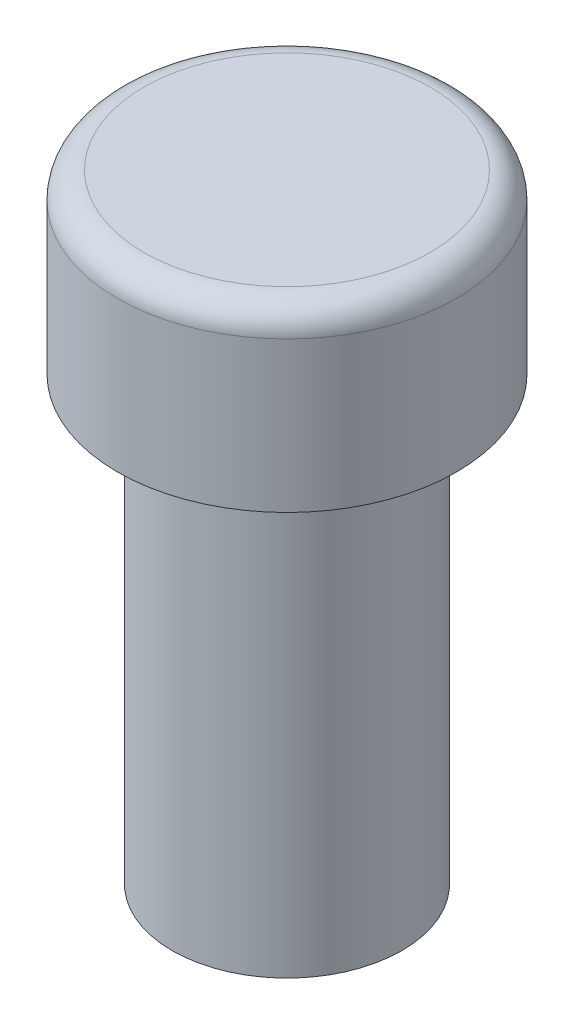
ISO-10303-21;
HEADER;
FILE_DESCRIPTION(('STEP AP214'),'2;1');
FILE_NAME('part.step','',(''),(''),'','','');
FILE_SCHEMA(('AUTOMOTIVE_DESIGN { 1 0 10303 214 1 1 1 1 }'));
ENDSEC;
DATA;
#1=APPLICATION_CONTEXT('core data for automotive mechanical design processes');
#2=APPLICATION_PROTOCOL_DEFINITION('international standard','automotive_design',2000,#1);
#3=PRODUCT_CONTEXT('',#1,'mechanical');
#4=PRODUCT('Part','Part','',(#3));
#5=PRODUCT_RELATED_PRODUCT_CATEGORY('part','',(#4));
#6=PRODUCT_DEFINITION_FORMATION('','',#4);
#7=PRODUCT_DEFINITION_CONTEXT('part definition',#1,'design');
#8=PRODUCT_DEFINITION('design','',#6,#7);
#9=PRODUCT_DEFINITION_SHAPE('','',#8);
#10=(LENGTH_UNIT() NAMED_UNIT(*) SI_UNIT(.MILLI.,.METRE.));
#11=(NAMED_UNIT(*) PLANE_ANGLE_UNIT() SI_UNIT($,.RADIAN.));
#12=(NAMED_UNIT(*) SI_UNIT($,.STERADIAN.) SOLID_ANGLE_UNIT());
#13=UNCERTAINTY_MEASURE_WITH_UNIT(LENGTH_MEASURE(1.E-05),#10,'distance_accuracy_value','');
#14=(GEOMETRIC_REPRESENTATION_CONTEXT(3) GLOBAL_UNCERTAINTY_ASSIGNED_CONTEXT((#13)) GLOBAL_UNIT_ASSIGNED_CONTEXT((#10,
#11,#12)) REPRESENTATION_CONTEXT('',''));
#15=CARTESIAN_POINT('',(0.,0.,0.));
#16=DIRECTION('',(0.,0.,1.));
#17=DIRECTION('',(1.,0.,0.));
#18=AXIS2_PLACEMENT_3D('',#15,#16,#17);
#19=CARTESIAN_POINT('',(0.,12.5,0.));
#20=DIRECTION('',(0.,-1.,0.));
#21=DIRECTION('',(0.,0.,-1.));
#22=AXIS2_PLACEMENT_3D('',#19,#20,#21);
#23=CYLINDRICAL_SURFACE('',#22,3.25);
#24=CARTESIAN_POINT('',(0.,12.5,0.));
#25=DIRECTION('',(0.,1.,0.));
#26=DIRECTION('',(0.,0.,1.));
#27=AXIS2_PLACEMENT_3D('',#24,#25,#26);
#28=CIRCLE('',#27,3.25);
#29=CARTESIAN_POINT('',(0.,12.5,3.25));
#30=VERTEX_POINT('',#29);
#31=EDGE_CURVE('E74',#30,#30,#28,.T.);
#32=ORIENTED_EDGE('',*,*,#31,.F.);
#33=EDGE_LOOP('',(#32));
#34=FACE_BOUND('',#33,.T.);
#35=CARTESIAN_POINT('',(0.,0.,0.));
#36=DIRECTION('',(0.,1.,0.));
#37=DIRECTION('',(0.,0.,1.));
#38=AXIS2_PLACEMENT_3D('',#35,#36,#37);
#39=CIRCLE('',#38,3.25);
#40=CARTESIAN_POINT('',(0.,0.,3.25));
#41=VERTEX_POINT('',#40);
#42=EDGE_CURVE('E79',#41,#41,#39,.T.);
#43=ORIENTED_EDGE('',*,*,#42,.T.);
#44=EDGE_LOOP('',(#43));
#45=FACE_BOUND('',#44,.T.);
#46=ADVANCED_FACE('F61',(#34,#45),#23,.T.);
#47=CARTESIAN_POINT('',(0.,0.,0.));
#48=DIRECTION('',(0.,1.,0.));
#49=DIRECTION('',(0.,0.,1.));
#50=AXIS2_PLACEMENT_3D('',#47,#48,#49);
#51=PLANE('',#50);
#52=CARTESIAN_POINT('',(0.,0.,0.));
#53=DIRECTION('',(0.,-1.,0.));
#54=DIRECTION('',(0.,0.,-1.));
#55=AXIS2_PLACEMENT_3D('',#52,#53,#54);
#56=CIRCLE('',#55,1.75);
#57=CARTESIAN_POINT('',(0.,0.,-1.75));
#58=VERTEX_POINT('',#57);
#59=EDGE_CURVE('E86',#58,#58,#56,.T.);
#60=ORIENTED_EDGE('',*,*,#59,.F.);
#61=EDGE_LOOP('',(#60));
#62=FACE_BOUND('',#61,.T.);
#63=ORIENTED_EDGE('',*,*,#42,.F.);
#64=EDGE_LOOP('',(#63));
#65=FACE_BOUND('',#64,.T.);
#66=ADVANCED_FACE('F115',(#62,#65),#51,.F.);
#67=CARTESIAN_POINT('',(0.,2.5,0.));
#68=DIRECTION('',(0.,-1.,0.));
#69=DIRECTION('',(0.,0.,-1.));
#70=AXIS2_PLACEMENT_3D('',#67,#68,#69);
#71=CYLINDRICAL_SURFACE('',#70,1.75);
#72=CARTESIAN_POINT('',(0.,2.5,0.));
#73=DIRECTION('',(0.,-1.,0.));
#74=DIRECTION('',(0.,0.,-1.));
#75=AXIS2_PLACEMENT_3D('',#72,#73,#74);
#76=CIRCLE('',#75,1.75);
#77=CARTESIAN_POINT('',(0.,2.5,-1.75));
#78=VERTEX_POINT('',#77);
#79=EDGE_CURVE('E84',#78,#78,#76,.T.);
#80=ORIENTED_EDGE('',*,*,#79,.F.);
#81=EDGE_LOOP('',(#80));
#82=FACE_BOUND('',#81,.T.);
#83=ORIENTED_EDGE('',*,*,#59,.T.);
#84=EDGE_LOOP('',(#83));
#85=FACE_BOUND('',#84,.T.);
#86=ADVANCED_FACE('F120',(#82,#85),#71,.F.);
#87=CARTESIAN_POINT('',(0.,2.5,0.));
#88=DIRECTION('',(0.,-1.,0.));
#89=DIRECTION('',(0.,0.,-1.));
#90=AXIS2_PLACEMENT_3D('',#87,#88,#89);
#91=PLANE('',#90);
#92=ORIENTED_EDGE('',*,*,#79,.T.);
#93=EDGE_LOOP('',(#92));
#94=FACE_BOUND('',#93,.T.);
#95=ADVANCED_FACE('F128',(#94),#91,.T.);
#96=CARTESIAN_POINT('',(0.,17.5,0.));
#97=DIRECTION('',(0.,-1.,0.));
#98=DIRECTION('',(0.,0.,-1.));
#99=AXIS2_PLACEMENT_3D('',#96,#97,#98);
#100=CYLINDRICAL_SURFACE('',#99,4.8);
#101=CARTESIAN_POINT('',(0.,16.75,0.));
#102=DIRECTION('',(0.,1.,0.));
#103=DIRECTION('',(0.,0.,1.));
#104=AXIS2_PLACEMENT_3D('',#101,#102,#103);
#105=CIRCLE('',#104,4.8);
#106=CARTESIAN_POINT('',(0.,16.75,4.8));
#107=VERTEX_POINT('',#106);
#108=EDGE_CURVE('E11',#107,#107,#105,.F.);
#109=ORIENTED_EDGE('',*,*,#108,.T.);
#110=EDGE_LOOP('',(#109));
#111=FACE_BOUND('',#110,.T.);
#112=CARTESIAN_POINT('',(0.,12.5,0.));
#113=DIRECTION('',(0.,1.,0.));
#114=DIRECTION('',(0.,0.,1.));
#115=AXIS2_PLACEMENT_3D('',#112,#113,#114);
#116=CIRCLE('',#115,4.8);
#117=CARTESIAN_POINT('',(0.,12.5,4.8));
#118=VERTEX_POINT('',#117);
#119=EDGE_CURVE('E90',#118,#118,#116,.T.);
#120=ORIENTED_EDGE('',*,*,#119,.T.);
#121=EDGE_LOOP('',(#120));
#122=FACE_BOUND('',#121,.T.);
#123=ADVANCED_FACE('F98',(#111,#122),#100,.T.);
#124=CARTESIAN_POINT('',(0.,17.5,0.));
#125=DIRECTION('',(0.,1.,0.));
#126=DIRECTION('',(0.,0.,1.));
#127=AXIS2_PLACEMENT_3D('',#124,#125,#126);
#128=PLANE('',#127);
#129=CARTESIAN_POINT('',(0.,17.5,0.));
#130=DIRECTION('',(0.,1.,0.));
#131=DIRECTION('',(0.,0.,1.));
#132=AXIS2_PLACEMENT_3D('',#129,#130,#131);
#133=CIRCLE('',#132,4.05);
#134=CARTESIAN_POINT('',(0.,17.5,4.05));
#135=VERTEX_POINT('',#134);
#136=EDGE_CURVE('E69',#135,#135,#133,.T.);
#137=ORIENTED_EDGE('',*,*,#136,.T.);
#138=EDGE_LOOP('',(#137));
#139=FACE_BOUND('',#138,.T.);
#140=ADVANCED_FACE('F102',(#139),#128,.T.);
#141=CARTESIAN_POINT('',(0.,12.5,0.));
#142=DIRECTION('',(0.,1.,0.));
#143=DIRECTION('',(0.,0.,1.));
#144=AXIS2_PLACEMENT_3D('',#141,#142,#143);
#145=PLANE('',#144);
#146=ORIENTED_EDGE('',*,*,#31,.T.);
#147=EDGE_LOOP('',(#146));
#148=FACE_BOUND('',#147,.T.);
#149=ORIENTED_EDGE('',*,*,#119,.F.);
#150=EDGE_LOOP('',(#149));
#151=FACE_BOUND('',#150,.T.);
#152=ADVANCED_FACE('F100',(#148,#151),#145,.F.);
#153=CARTESIAN_POINT('',(0.,16.75,0.));
#154=DIRECTION('',(0.,1.,0.));
#155=DIRECTION('',(0.,0.,1.));
#156=AXIS2_PLACEMENT_3D('',#153,#154,#155);
#157=TOROIDAL_SURFACE('',#156,4.05,0.75);
#158=ORIENTED_EDGE('',*,*,#108,.F.);
#159=EDGE_LOOP('',(#158));
#160=FACE_BOUND('',#159,.T.);
#161=ORIENTED_EDGE('',*,*,#136,.F.);
#162=EDGE_LOOP('',(#161));
#163=FACE_BOUND('',#162,.T.);
#164=ADVANCED_FACE('F63',(#160,#163),#157,.T.);
#165=CLOSED_SHELL('',(#46,#66,#86,#95,#123,#140,#152,#164));
#166=MANIFOLD_SOLID_BREP('B2',#165);
#167=ADVANCED_BREP_SHAPE_REPRESENTATION('',(#18,#166),#14);
#168=SHAPE_DEFINITION_REPRESENTATION(#9,#167);
ENDSEC;
END-ISO-10303-21;
